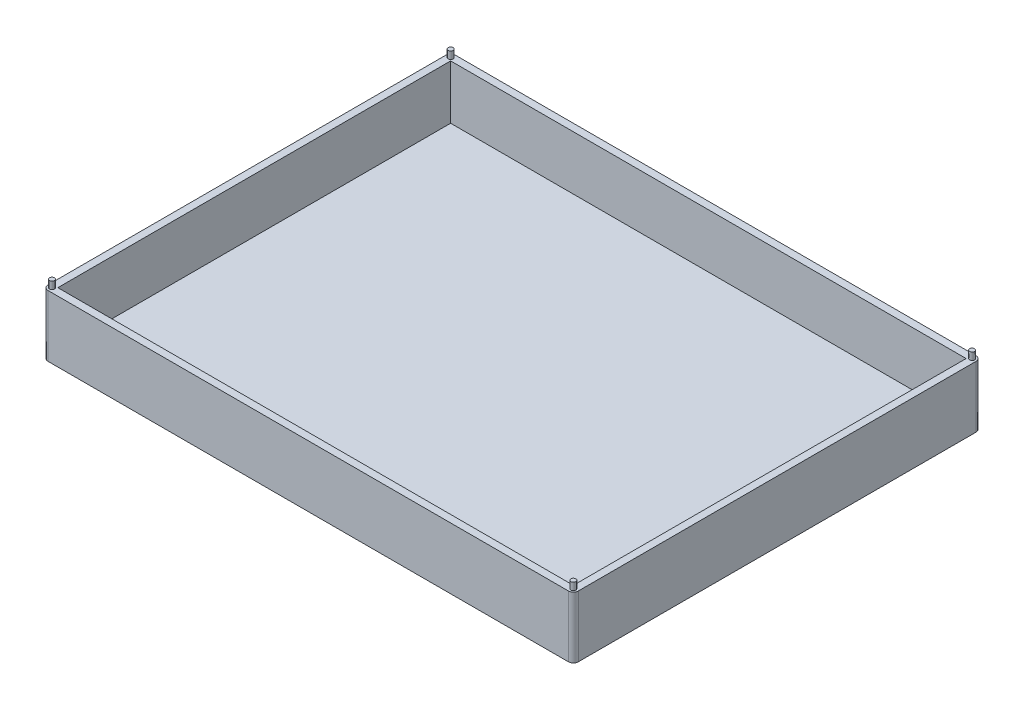
ISO-10303-21;
HEADER;
FILE_DESCRIPTION(('STEP AP214'),'2;1');
FILE_NAME('part.step','',(''),(''),'','','');
FILE_SCHEMA(('AUTOMOTIVE_DESIGN { 1 0 10303 214 1 1 1 1 }'));
ENDSEC;
DATA;
#1=APPLICATION_CONTEXT('core data for automotive mechanical design processes');
#2=APPLICATION_PROTOCOL_DEFINITION('international standard','automotive_design',2000,#1);
#3=PRODUCT_CONTEXT('',#1,'mechanical');
#4=PRODUCT('Part','Part','',(#3));
#5=PRODUCT_RELATED_PRODUCT_CATEGORY('part','',(#4));
#6=PRODUCT_DEFINITION_FORMATION('','',#4);
#7=PRODUCT_DEFINITION_CONTEXT('part definition',#1,'design');
#8=PRODUCT_DEFINITION('design','',#6,#7);
#9=PRODUCT_DEFINITION_SHAPE('','',#8);
#10=(LENGTH_UNIT() NAMED_UNIT(*) SI_UNIT(.MILLI.,.METRE.));
#11=(NAMED_UNIT(*) PLANE_ANGLE_UNIT() SI_UNIT($,.RADIAN.));
#12=(NAMED_UNIT(*) SI_UNIT($,.STERADIAN.) SOLID_ANGLE_UNIT());
#13=UNCERTAINTY_MEASURE_WITH_UNIT(LENGTH_MEASURE(1.E-05),#10,'distance_accuracy_value','');
#14=(GEOMETRIC_REPRESENTATION_CONTEXT(3) GLOBAL_UNCERTAINTY_ASSIGNED_CONTEXT((#13)) GLOBAL_UNIT_ASSIGNED_CONTEXT((#10,
#11,#12)) REPRESENTATION_CONTEXT('',''));
#15=CARTESIAN_POINT('',(0.,0.,0.));
#16=DIRECTION('',(0.,0.,1.));
#17=DIRECTION('',(1.,0.,0.));
#18=AXIS2_PLACEMENT_3D('',#15,#16,#17);
#19=CARTESIAN_POINT('',(0.,25.,0.));
#20=DIRECTION('',(0.,1.,0.));
#21=DIRECTION('',(0.,0.,1.));
#22=AXIS2_PLACEMENT_3D('',#19,#20,#21);
#23=PLANE('',#22);
#24=CARTESIAN_POINT('',(157.231114613234,25.,-60.6881794418821));
#25=DIRECTION('',(0.,1.,0.));
#26=DIRECTION('',(0.,0.,1.));
#27=AXIS2_PLACEMENT_3D('',#24,#25,#26);
#28=CIRCLE('',#27,0.999999999999998);
#29=CARTESIAN_POINT('',(157.231114613234,25.,-59.6881794418821));
#30=VERTEX_POINT('',#29);
#31=EDGE_CURVE('E514',#30,#30,#28,.T.);
#32=ORIENTED_EDGE('',*,*,#31,.F.);
#33=EDGE_LOOP('',(#32));
#34=FACE_BOUND('',#33,.T.);
#35=CARTESIAN_POINT('',(157.231114613234,25.,101.711820558118));
#36=DIRECTION('',(0.,1.,0.));
#37=DIRECTION('',(0.,0.,1.));
#38=AXIS2_PLACEMENT_3D('',#35,#36,#37);
#39=CIRCLE('',#38,0.999999999999998);
#40=CARTESIAN_POINT('',(157.231114613234,25.,102.711820558118));
#41=VERTEX_POINT('',#40);
#42=EDGE_CURVE('E506',#41,#41,#39,.T.);
#43=ORIENTED_EDGE('',*,*,#42,.F.);
#44=EDGE_LOOP('',(#43));
#45=FACE_BOUND('',#44,.T.);
#46=CARTESIAN_POINT('',(-55.168885386766,25.,101.711820558118));
#47=DIRECTION('',(0.,1.,0.));
#48=DIRECTION('',(0.,0.,1.));
#49=AXIS2_PLACEMENT_3D('',#46,#47,#48);
#50=CIRCLE('',#49,0.999999999999998);
#51=CARTESIAN_POINT('',(-55.168885386766,25.,102.711820558118));
#52=VERTEX_POINT('',#51);
#53=EDGE_CURVE('E498',#52,#52,#50,.T.);
#54=ORIENTED_EDGE('',*,*,#53,.F.);
#55=EDGE_LOOP('',(#54));
#56=FACE_BOUND('',#55,.T.);
#57=CARTESIAN_POINT('',(-55.168885386766,25.,-60.6881794418821));
#58=DIRECTION('',(0.,1.,0.));
#59=DIRECTION('',(0.,0.,1.));
#60=AXIS2_PLACEMENT_3D('',#57,#58,#59);
#61=CIRCLE('',#60,0.999999999999998);
#62=CARTESIAN_POINT('',(-55.168885386766,25.,-59.6881794418821));
#63=VERTEX_POINT('',#62);
#64=EDGE_CURVE('E490',#63,#63,#61,.T.);
#65=ORIENTED_EDGE('',*,*,#64,.F.);
#66=EDGE_LOOP('',(#65));
#67=FACE_BOUND('',#66,.T.);
#68=DIRECTION('',(-1.,0.,0.));
#69=VECTOR('',#68,1.);
#70=CARTESIAN_POINT('',(159.031114613234,25.,-62.4881794418821));
#71=LINE('',#70,#69);
#72=CARTESIAN_POINT('',(157.031114613234,25.,-62.4881794418821));
#73=VERTEX_POINT('',#72);
#74=CARTESIAN_POINT('',(-54.968885386766,25.,-62.4881794418821));
#75=VERTEX_POINT('',#74);
#76=EDGE_CURVE('E198',#73,#75,#71,.T.);
#77=ORIENTED_EDGE('',*,*,#76,.T.);
#78=CARTESIAN_POINT('',(-54.968885386766,25.,-60.4881794418821));
#79=DIRECTION('',(0.,1.,0.));
#80=DIRECTION('',(0.,0.,1.));
#81=AXIS2_PLACEMENT_3D('',#78,#79,#80);
#82=CIRCLE('',#81,2.);
#83=CARTESIAN_POINT('',(-56.968885386766,25.,-60.4881794418821));
#84=VERTEX_POINT('',#83);
#85=EDGE_CURVE('E12',#75,#84,#82,.T.);
#86=ORIENTED_EDGE('',*,*,#85,.T.);
#87=DIRECTION('',(0.,0.,1.));
#88=VECTOR('',#87,1.);
#89=CARTESIAN_POINT('',(-56.968885386766,25.,-62.4881794418821));
#90=LINE('',#89,#88);
#91=CARTESIAN_POINT('',(-56.968885386766,25.,101.511820558118));
#92=VERTEX_POINT('',#91);
#93=EDGE_CURVE('E194',#84,#92,#90,.T.);
#94=ORIENTED_EDGE('',*,*,#93,.T.);
#95=CARTESIAN_POINT('',(-54.968885386766,25.,101.511820558118));
#96=DIRECTION('',(0.,1.,0.));
#97=DIRECTION('',(0.,0.,1.));
#98=AXIS2_PLACEMENT_3D('',#95,#96,#97);
#99=CIRCLE('',#98,2.);
#100=CARTESIAN_POINT('',(-54.968885386766,25.,103.511820558118));
#101=VERTEX_POINT('',#100);
#102=EDGE_CURVE('E255',#92,#101,#99,.T.);
#103=ORIENTED_EDGE('',*,*,#102,.T.);
#104=DIRECTION('',(-1.,0.,0.));
#105=VECTOR('',#104,1.);
#106=CARTESIAN_POINT('',(159.031114613234,25.,103.511820558118));
#107=LINE('',#106,#105);
#108=CARTESIAN_POINT('',(157.031114613234,25.,103.511820558118));
#109=VERTEX_POINT('',#108);
#110=EDGE_CURVE('E190',#109,#101,#107,.T.);
#111=ORIENTED_EDGE('',*,*,#110,.F.);
#112=CARTESIAN_POINT('',(157.031114613234,25.,101.511820558118));
#113=DIRECTION('',(0.,1.,0.));
#114=DIRECTION('',(0.,0.,1.));
#115=AXIS2_PLACEMENT_3D('',#112,#113,#114);
#116=CIRCLE('',#115,2.);
#117=CARTESIAN_POINT('',(159.031114613234,25.,101.511820558118));
#118=VERTEX_POINT('',#117);
#119=EDGE_CURVE('E240',#109,#118,#116,.T.);
#120=ORIENTED_EDGE('',*,*,#119,.T.);
#121=DIRECTION('',(0.,0.,1.));
#122=VECTOR('',#121,1.);
#123=CARTESIAN_POINT('',(159.031114613234,25.,-62.4881794418821));
#124=LINE('',#123,#122);
#125=CARTESIAN_POINT('',(159.031114613234,25.,-60.4881794418821));
#126=VERTEX_POINT('',#125);
#127=EDGE_CURVE('E201',#126,#118,#124,.T.);
#128=ORIENTED_EDGE('',*,*,#127,.F.);
#129=CARTESIAN_POINT('',(157.031114613234,25.,-60.4881794418821));
#130=DIRECTION('',(0.,1.,0.));
#131=DIRECTION('',(0.,0.,1.));
#132=AXIS2_PLACEMENT_3D('',#129,#130,#131);
#133=CIRCLE('',#132,2.);
#134=EDGE_CURVE('E227',#126,#73,#133,.T.);
#135=ORIENTED_EDGE('',*,*,#134,.T.);
#136=EDGE_LOOP('',(#77,#86,#94,#103,#111,#120,#128,#135));
#137=FACE_BOUND('',#136,.T.);
#138=DIRECTION('',(1.,0.,0.));
#139=VECTOR('',#138,1.);
#140=CARTESIAN_POINT('',(-53.968885386766,25.,100.511820558118));
#141=LINE('',#140,#139);
#142=CARTESIAN_POINT('',(-53.968885386766,25.,100.511820558118));
#143=VERTEX_POINT('',#142);
#144=CARTESIAN_POINT('',(156.031114613234,25.,100.511820558118));
#145=VERTEX_POINT('',#144);
#146=EDGE_CURVE('E178',#143,#145,#141,.T.);
#147=ORIENTED_EDGE('',*,*,#146,.F.);
#148=DIRECTION('',(0.,0.,1.));
#149=VECTOR('',#148,1.);
#150=CARTESIAN_POINT('',(-53.968885386766,25.,-59.4881794418821));
#151=LINE('',#150,#149);
#152=CARTESIAN_POINT('',(-53.968885386766,25.,-59.4881794418821));
#153=VERTEX_POINT('',#152);
#154=EDGE_CURVE('E471',#153,#143,#151,.T.);
#155=ORIENTED_EDGE('',*,*,#154,.F.);
#156=DIRECTION('',(1.,0.,0.));
#157=VECTOR('',#156,1.);
#158=CARTESIAN_POINT('',(-53.968885386766,25.,-59.4881794418821));
#159=LINE('',#158,#157);
#160=CARTESIAN_POINT('',(156.031114613234,25.,-59.4881794418821));
#161=VERTEX_POINT('',#160);
#162=EDGE_CURVE('E474',#153,#161,#159,.T.);
#163=ORIENTED_EDGE('',*,*,#162,.T.);
#164=DIRECTION('',(0.,0.,1.));
#165=VECTOR('',#164,1.);
#166=CARTESIAN_POINT('',(156.031114613234,25.,-59.4881794418821));
#167=LINE('',#166,#165);
#168=EDGE_CURVE('E478',#161,#145,#167,.T.);
#169=ORIENTED_EDGE('',*,*,#168,.T.);
#170=EDGE_LOOP('',(#147,#155,#163,#169));
#171=FACE_BOUND('',#170,.T.);
#172=ADVANCED_FACE('F63',(#34,#45,#56,#67,#137,#171),#23,.T.);
#173=CARTESIAN_POINT('',(0.,0.,0.));
#174=DIRECTION('',(0.,1.,0.));
#175=DIRECTION('',(0.,0.,1.));
#176=AXIS2_PLACEMENT_3D('',#173,#174,#175);
#177=PLANE('',#176);
#178=DIRECTION('',(0.,0.,1.));
#179=VECTOR('',#178,1.);
#180=CARTESIAN_POINT('',(-56.968885386766,0.,-62.4881794418821));
#181=LINE('',#180,#179);
#182=CARTESIAN_POINT('',(-56.968885386766,0.,-60.4881794418821));
#183=VERTEX_POINT('',#182);
#184=CARTESIAN_POINT('',(-56.968885386766,0.,101.511820558118));
#185=VERTEX_POINT('',#184);
#186=EDGE_CURVE('E209',#183,#185,#181,.T.);
#187=ORIENTED_EDGE('',*,*,#186,.F.);
#188=CARTESIAN_POINT('',(-54.968885386766,0.,-60.4881794418821));
#189=DIRECTION('',(0.,1.,0.));
#190=DIRECTION('',(0.,0.,1.));
#191=AXIS2_PLACEMENT_3D('',#188,#189,#190);
#192=CIRCLE('',#191,2.);
#193=CARTESIAN_POINT('',(-54.968885386766,0.,-62.4881794418821));
#194=VERTEX_POINT('',#193);
#195=EDGE_CURVE('E86',#183,#194,#192,.F.);
#196=ORIENTED_EDGE('',*,*,#195,.T.);
#197=DIRECTION('',(-1.,0.,0.));
#198=VECTOR('',#197,1.);
#199=CARTESIAN_POINT('',(159.031114613234,0.,-62.4881794418821));
#200=LINE('',#199,#198);
#201=CARTESIAN_POINT('',(157.031114613234,0.,-62.4881794418821));
#202=VERTEX_POINT('',#201);
#203=EDGE_CURVE('E212',#202,#194,#200,.T.);
#204=ORIENTED_EDGE('',*,*,#203,.F.);
#205=CARTESIAN_POINT('',(157.031114613234,0.,-60.4881794418821));
#206=DIRECTION('',(0.,1.,0.));
#207=DIRECTION('',(0.,0.,1.));
#208=AXIS2_PLACEMENT_3D('',#205,#206,#207);
#209=CIRCLE('',#208,2.);
#210=CARTESIAN_POINT('',(159.031114613234,0.,-60.4881794418821));
#211=VERTEX_POINT('',#210);
#212=EDGE_CURVE('E221',#202,#211,#209,.F.);
#213=ORIENTED_EDGE('',*,*,#212,.T.);
#214=DIRECTION('',(0.,0.,1.));
#215=VECTOR('',#214,1.);
#216=CARTESIAN_POINT('',(159.031114613234,0.,-62.4881794418821));
#217=LINE('',#216,#215);
#218=CARTESIAN_POINT('',(159.031114613234,0.,101.511820558118));
#219=VERTEX_POINT('',#218);
#220=EDGE_CURVE('E195',#211,#219,#217,.T.);
#221=ORIENTED_EDGE('',*,*,#220,.T.);
#222=CARTESIAN_POINT('',(157.031114613234,0.,101.511820558118));
#223=DIRECTION('',(0.,1.,0.));
#224=DIRECTION('',(0.,0.,1.));
#225=AXIS2_PLACEMENT_3D('',#222,#223,#224);
#226=CIRCLE('',#225,2.);
#227=CARTESIAN_POINT('',(157.031114613234,0.,103.511820558118));
#228=VERTEX_POINT('',#227);
#229=EDGE_CURVE('E234',#219,#228,#226,.F.);
#230=ORIENTED_EDGE('',*,*,#229,.T.);
#231=DIRECTION('',(-1.,0.,0.));
#232=VECTOR('',#231,1.);
#233=CARTESIAN_POINT('',(159.031114613234,0.,103.511820558118));
#234=LINE('',#233,#232);
#235=CARTESIAN_POINT('',(-54.968885386766,0.,103.511820558118));
#236=VERTEX_POINT('',#235);
#237=EDGE_CURVE('E184',#228,#236,#234,.T.);
#238=ORIENTED_EDGE('',*,*,#237,.T.);
#239=CARTESIAN_POINT('',(-54.968885386766,0.,101.511820558118));
#240=DIRECTION('',(0.,1.,0.));
#241=DIRECTION('',(0.,0.,1.));
#242=AXIS2_PLACEMENT_3D('',#239,#240,#241);
#243=CIRCLE('',#242,2.);
#244=EDGE_CURVE('E247',#236,#185,#243,.F.);
#245=ORIENTED_EDGE('',*,*,#244,.T.);
#246=EDGE_LOOP('',(#187,#196,#204,#213,#221,#230,#238,#245));
#247=FACE_BOUND('',#246,.T.);
#248=ADVANCED_FACE('F270',(#247),#177,.F.);
#249=CARTESIAN_POINT('',(159.031114613234,25.,103.511820558118));
#250=DIRECTION('',(0.,0.,1.));
#251=DIRECTION('',(1.,0.,0.));
#252=AXIS2_PLACEMENT_3D('',#249,#250,#251);
#253=PLANE('',#252);
#254=ORIENTED_EDGE('',*,*,#110,.T.);
#255=DIRECTION('',(0.,-1.,0.));
#256=VECTOR('',#255,1.);
#257=CARTESIAN_POINT('',(-54.968885386766,0.,103.511820558118));
#258=LINE('',#257,#256);
#259=EDGE_CURVE('E243',#101,#236,#258,.T.);
#260=ORIENTED_EDGE('',*,*,#259,.T.);
#261=ORIENTED_EDGE('',*,*,#237,.F.);
#262=DIRECTION('',(0.,-1.,0.));
#263=VECTOR('',#262,1.);
#264=CARTESIAN_POINT('',(157.031114613234,25.,103.511820558118));
#265=LINE('',#264,#263);
#266=EDGE_CURVE('E237',#228,#109,#265,.F.);
#267=ORIENTED_EDGE('',*,*,#266,.T.);
#268=EDGE_LOOP('',(#254,#260,#261,#267));
#269=FACE_BOUND('',#268,.T.);
#270=ADVANCED_FACE('F282',(#269),#253,.T.);
#271=CARTESIAN_POINT('',(159.031114613234,25.,-62.4881794418821));
#272=DIRECTION('',(1.,0.,0.));
#273=DIRECTION('',(0.,0.,-1.));
#274=AXIS2_PLACEMENT_3D('',#271,#272,#273);
#275=PLANE('',#274);
#276=ORIENTED_EDGE('',*,*,#127,.T.);
#277=DIRECTION('',(0.,-1.,0.));
#278=VECTOR('',#277,1.);
#279=CARTESIAN_POINT('',(159.031114613234,25.,101.511820558118));
#280=LINE('',#279,#278);
#281=EDGE_CURVE('E230',#118,#219,#280,.T.);
#282=ORIENTED_EDGE('',*,*,#281,.T.);
#283=ORIENTED_EDGE('',*,*,#220,.F.);
#284=DIRECTION('',(0.,-1.,0.));
#285=VECTOR('',#284,1.);
#286=CARTESIAN_POINT('',(159.031114613234,25.,-60.4881794418821));
#287=LINE('',#286,#285);
#288=EDGE_CURVE('E224',#211,#126,#287,.F.);
#289=ORIENTED_EDGE('',*,*,#288,.T.);
#290=EDGE_LOOP('',(#276,#282,#283,#289));
#291=FACE_BOUND('',#290,.T.);
#292=ADVANCED_FACE('F290',(#291),#275,.T.);
#293=CARTESIAN_POINT('',(159.031114613234,25.,-62.4881794418821));
#294=DIRECTION('',(0.,0.,1.));
#295=DIRECTION('',(1.,0.,0.));
#296=AXIS2_PLACEMENT_3D('',#293,#294,#295);
#297=PLANE('',#296);
#298=ORIENTED_EDGE('',*,*,#203,.T.);
#299=DIRECTION('',(0.,-1.,0.));
#300=VECTOR('',#299,1.);
#301=CARTESIAN_POINT('',(-54.968885386766,25.,-62.4881794418821));
#302=LINE('',#301,#300);
#303=EDGE_CURVE('E72',#194,#75,#302,.F.);
#304=ORIENTED_EDGE('',*,*,#303,.T.);
#305=ORIENTED_EDGE('',*,*,#76,.F.);
#306=DIRECTION('',(0.,-1.,0.));
#307=VECTOR('',#306,1.);
#308=CARTESIAN_POINT('',(157.031114613234,0.,-62.4881794418821));
#309=LINE('',#308,#307);
#310=EDGE_CURVE('E205',#73,#202,#309,.T.);
#311=ORIENTED_EDGE('',*,*,#310,.T.);
#312=EDGE_LOOP('',(#298,#304,#305,#311));
#313=FACE_BOUND('',#312,.T.);
#314=ADVANCED_FACE('F296',(#313),#297,.F.);
#315=CARTESIAN_POINT('',(-56.968885386766,25.,-62.4881794418821));
#316=DIRECTION('',(1.,0.,0.));
#317=DIRECTION('',(0.,0.,-1.));
#318=AXIS2_PLACEMENT_3D('',#315,#316,#317);
#319=PLANE('',#318);
#320=ORIENTED_EDGE('',*,*,#93,.F.);
#321=DIRECTION('',(0.,-1.,0.));
#322=VECTOR('',#321,1.);
#323=CARTESIAN_POINT('',(-56.968885386766,25.,-60.4881794418821));
#324=LINE('',#323,#322);
#325=EDGE_CURVE('E258',#84,#183,#324,.T.);
#326=ORIENTED_EDGE('',*,*,#325,.T.);
#327=ORIENTED_EDGE('',*,*,#186,.T.);
#328=DIRECTION('',(0.,-1.,0.));
#329=VECTOR('',#328,1.);
#330=CARTESIAN_POINT('',(-56.968885386766,25.,101.511820558118));
#331=LINE('',#330,#329);
#332=EDGE_CURVE('E251',#185,#92,#331,.F.);
#333=ORIENTED_EDGE('',*,*,#332,.T.);
#334=EDGE_LOOP('',(#320,#326,#327,#333));
#335=FACE_BOUND('',#334,.T.);
#336=ADVANCED_FACE('F267',(#335),#319,.F.);
#337=CARTESIAN_POINT('',(-53.968885386766,25.,-59.4881794418821));
#338=DIRECTION('',(1.,0.,0.));
#339=DIRECTION('',(0.,0.,-1.));
#340=AXIS2_PLACEMENT_3D('',#337,#338,#339);
#341=PLANE('',#340);
#342=DIRECTION('',(0.,0.,-1.));
#343=VECTOR('',#342,1.);
#344=CARTESIAN_POINT('',(-53.968885386766,3.,100.511820558118));
#345=LINE('',#344,#343);
#346=CARTESIAN_POINT('',(-53.968885386766,3.,100.511820558118));
#347=VERTEX_POINT('',#346);
#348=CARTESIAN_POINT('',(-53.968885386766,3.,-59.4881794418821));
#349=VERTEX_POINT('',#348);
#350=EDGE_CURVE('E158',#347,#349,#345,.T.);
#351=ORIENTED_EDGE('',*,*,#350,.T.);
#352=DIRECTION('',(0.,-1.,0.));
#353=VECTOR('',#352,1.);
#354=CARTESIAN_POINT('',(-53.968885386766,25.,-59.4881794418821));
#355=LINE('',#354,#353);
#356=EDGE_CURVE('E186',#153,#349,#355,.T.);
#357=ORIENTED_EDGE('',*,*,#356,.F.);
#358=ORIENTED_EDGE('',*,*,#154,.T.);
#359=DIRECTION('',(0.,-1.,0.));
#360=VECTOR('',#359,1.);
#361=CARTESIAN_POINT('',(-53.968885386766,25.,100.511820558118));
#362=LINE('',#361,#360);
#363=EDGE_CURVE('E180',#143,#347,#362,.T.);
#364=ORIENTED_EDGE('',*,*,#363,.T.);
#365=EDGE_LOOP('',(#351,#357,#358,#364));
#366=FACE_BOUND('',#365,.T.);
#367=ADVANCED_FACE('F316',(#366),#341,.T.);
#368=CARTESIAN_POINT('',(-53.968885386766,25.,100.511820558118));
#369=DIRECTION('',(0.,0.,-1.));
#370=DIRECTION('',(-1.,0.,0.));
#371=AXIS2_PLACEMENT_3D('',#368,#369,#370);
#372=PLANE('',#371);
#373=DIRECTION('',(1.,0.,0.));
#374=VECTOR('',#373,1.);
#375=CARTESIAN_POINT('',(-53.968885386766,3.,100.511820558118));
#376=LINE('',#375,#374);
#377=CARTESIAN_POINT('',(156.031114613234,3.,100.511820558118));
#378=VERTEX_POINT('',#377);
#379=EDGE_CURVE('E152',#347,#378,#376,.T.);
#380=ORIENTED_EDGE('',*,*,#379,.F.);
#381=ORIENTED_EDGE('',*,*,#363,.F.);
#382=ORIENTED_EDGE('',*,*,#146,.T.);
#383=DIRECTION('',(0.,-1.,0.));
#384=VECTOR('',#383,1.);
#385=CARTESIAN_POINT('',(156.031114613234,25.,100.511820558118));
#386=LINE('',#385,#384);
#387=EDGE_CURVE('E169',#145,#378,#386,.T.);
#388=ORIENTED_EDGE('',*,*,#387,.T.);
#389=EDGE_LOOP('',(#380,#381,#382,#388));
#390=FACE_BOUND('',#389,.T.);
#391=ADVANCED_FACE('F176',(#390),#372,.T.);
#392=CARTESIAN_POINT('',(156.031114613234,25.,-59.4881794418821));
#393=DIRECTION('',(1.,0.,0.));
#394=DIRECTION('',(0.,0.,-1.));
#395=AXIS2_PLACEMENT_3D('',#392,#393,#394);
#396=PLANE('',#395);
#397=DIRECTION('',(0.,-1.,0.));
#398=VECTOR('',#397,1.);
#399=CARTESIAN_POINT('',(156.031114613234,25.,-59.4881794418821));
#400=LINE('',#399,#398);
#401=CARTESIAN_POINT('',(156.031114613234,3.,-59.4881794418821));
#402=VERTEX_POINT('',#401);
#403=EDGE_CURVE('E172',#161,#402,#400,.T.);
#404=ORIENTED_EDGE('',*,*,#403,.T.);
#405=DIRECTION('',(0.,0.,-1.));
#406=VECTOR('',#405,1.);
#407=CARTESIAN_POINT('',(156.031114613234,3.,100.511820558118));
#408=LINE('',#407,#406);
#409=EDGE_CURVE('E155',#378,#402,#408,.T.);
#410=ORIENTED_EDGE('',*,*,#409,.F.);
#411=ORIENTED_EDGE('',*,*,#387,.F.);
#412=ORIENTED_EDGE('',*,*,#168,.F.);
#413=EDGE_LOOP('',(#404,#410,#411,#412));
#414=FACE_BOUND('',#413,.T.);
#415=ADVANCED_FACE('F168',(#414),#396,.F.);
#416=CARTESIAN_POINT('',(-53.968885386766,25.,-59.4881794418821));
#417=DIRECTION('',(0.,0.,-1.));
#418=DIRECTION('',(-1.,0.,0.));
#419=AXIS2_PLACEMENT_3D('',#416,#417,#418);
#420=PLANE('',#419);
#421=ORIENTED_EDGE('',*,*,#356,.T.);
#422=DIRECTION('',(1.,0.,0.));
#423=VECTOR('',#422,1.);
#424=CARTESIAN_POINT('',(-53.968885386766,3.,-59.4881794418821));
#425=LINE('',#424,#423);
#426=EDGE_CURVE('E174',#349,#402,#425,.T.);
#427=ORIENTED_EDGE('',*,*,#426,.T.);
#428=ORIENTED_EDGE('',*,*,#403,.F.);
#429=ORIENTED_EDGE('',*,*,#162,.F.);
#430=EDGE_LOOP('',(#421,#427,#428,#429));
#431=FACE_BOUND('',#430,.T.);
#432=ADVANCED_FACE('F457',(#431),#420,.F.);
#433=CARTESIAN_POINT('',(0.,3.,0.));
#434=DIRECTION('',(0.,1.,0.));
#435=DIRECTION('',(0.,0.,1.));
#436=AXIS2_PLACEMENT_3D('',#433,#434,#435);
#437=PLANE('',#436);
#438=ORIENTED_EDGE('',*,*,#426,.F.);
#439=ORIENTED_EDGE('',*,*,#350,.F.);
#440=ORIENTED_EDGE('',*,*,#379,.T.);
#441=ORIENTED_EDGE('',*,*,#409,.T.);
#442=EDGE_LOOP('',(#438,#439,#440,#441));
#443=FACE_BOUND('',#442,.T.);
#444=ADVANCED_FACE('F154',(#443),#437,.T.);
#445=CARTESIAN_POINT('',(157.031114613234,25.,-60.4881794418821));
#446=DIRECTION('',(0.,1.,0.));
#447=DIRECTION('',(0.,0.,1.));
#448=AXIS2_PLACEMENT_3D('',#445,#446,#447);
#449=CYLINDRICAL_SURFACE('',#448,2.);
#450=ORIENTED_EDGE('',*,*,#134,.F.);
#451=ORIENTED_EDGE('',*,*,#288,.F.);
#452=ORIENTED_EDGE('',*,*,#212,.F.);
#453=ORIENTED_EDGE('',*,*,#310,.F.);
#454=EDGE_LOOP('',(#450,#451,#452,#453));
#455=FACE_BOUND('',#454,.T.);
#456=ADVANCED_FACE('F294',(#455),#449,.T.);
#457=CARTESIAN_POINT('',(157.031114613234,25.,101.511820558118));
#458=DIRECTION('',(0.,-1.,0.));
#459=DIRECTION('',(0.,0.,-1.));
#460=AXIS2_PLACEMENT_3D('',#457,#458,#459);
#461=CYLINDRICAL_SURFACE('',#460,2.);
#462=ORIENTED_EDGE('',*,*,#119,.F.);
#463=ORIENTED_EDGE('',*,*,#266,.F.);
#464=ORIENTED_EDGE('',*,*,#229,.F.);
#465=ORIENTED_EDGE('',*,*,#281,.F.);
#466=EDGE_LOOP('',(#462,#463,#464,#465));
#467=FACE_BOUND('',#466,.T.);
#468=ADVANCED_FACE('F285',(#467),#461,.T.);
#469=CARTESIAN_POINT('',(-54.968885386766,25.,101.511820558118));
#470=DIRECTION('',(0.,1.,0.));
#471=DIRECTION('',(0.,0.,1.));
#472=AXIS2_PLACEMENT_3D('',#469,#470,#471);
#473=CYLINDRICAL_SURFACE('',#472,2.);
#474=ORIENTED_EDGE('',*,*,#102,.F.);
#475=ORIENTED_EDGE('',*,*,#332,.F.);
#476=ORIENTED_EDGE('',*,*,#244,.F.);
#477=ORIENTED_EDGE('',*,*,#259,.F.);
#478=EDGE_LOOP('',(#474,#475,#476,#477));
#479=FACE_BOUND('',#478,.T.);
#480=ADVANCED_FACE('F276',(#479),#473,.T.);
#481=CARTESIAN_POINT('',(-54.968885386766,25.,-60.4881794418821));
#482=DIRECTION('',(0.,-1.,0.));
#483=DIRECTION('',(0.,0.,-1.));
#484=AXIS2_PLACEMENT_3D('',#481,#482,#483);
#485=CYLINDRICAL_SURFACE('',#484,2.);
#486=ORIENTED_EDGE('',*,*,#85,.F.);
#487=ORIENTED_EDGE('',*,*,#303,.F.);
#488=ORIENTED_EDGE('',*,*,#195,.F.);
#489=ORIENTED_EDGE('',*,*,#325,.F.);
#490=EDGE_LOOP('',(#486,#487,#488,#489));
#491=FACE_BOUND('',#490,.T.);
#492=ADVANCED_FACE('F65',(#491),#485,.T.);
#493=CARTESIAN_POINT('',(-55.168885386766,28.,-60.6881794418821));
#494=DIRECTION('',(0.,-1.,0.));
#495=DIRECTION('',(0.,0.,-1.));
#496=AXIS2_PLACEMENT_3D('',#493,#494,#495);
#497=CYLINDRICAL_SURFACE('',#496,0.999999999999998);
#498=CARTESIAN_POINT('',(-55.168885386766,28.,-60.6881794418821));
#499=DIRECTION('',(0.,1.,0.));
#500=DIRECTION('',(0.,0.,1.));
#501=AXIS2_PLACEMENT_3D('',#498,#499,#500);
#502=CIRCLE('',#501,0.999999999999998);
#503=CARTESIAN_POINT('',(-55.168885386766,28.,-59.6881794418821));
#504=VERTEX_POINT('',#503);
#505=EDGE_CURVE('E489',#504,#504,#502,.T.);
#506=ORIENTED_EDGE('',*,*,#505,.F.);
#507=EDGE_LOOP('',(#506));
#508=FACE_BOUND('',#507,.T.);
#509=ORIENTED_EDGE('',*,*,#64,.T.);
#510=EDGE_LOOP('',(#509));
#511=FACE_BOUND('',#510,.T.);
#512=ADVANCED_FACE('F298',(#508,#511),#497,.T.);
#513=CARTESIAN_POINT('',(-55.168885386766,28.,-60.6881794418821));
#514=DIRECTION('',(0.,1.,0.));
#515=DIRECTION('',(0.,0.,1.));
#516=AXIS2_PLACEMENT_3D('',#513,#514,#515);
#517=PLANE('',#516);
#518=ORIENTED_EDGE('',*,*,#505,.T.);
#519=EDGE_LOOP('',(#518));
#520=FACE_BOUND('',#519,.T.);
#521=ADVANCED_FACE('F303',(#520),#517,.T.);
#522=CARTESIAN_POINT('',(-55.168885386766,28.,101.711820558118));
#523=DIRECTION('',(0.,-1.,0.));
#524=DIRECTION('',(0.,0.,-1.));
#525=AXIS2_PLACEMENT_3D('',#522,#523,#524);
#526=CYLINDRICAL_SURFACE('',#525,0.999999999999998);
#527=CARTESIAN_POINT('',(-55.168885386766,28.,101.711820558118));
#528=DIRECTION('',(0.,1.,0.));
#529=DIRECTION('',(0.,0.,1.));
#530=AXIS2_PLACEMENT_3D('',#527,#528,#529);
#531=CIRCLE('',#530,0.999999999999998);
#532=CARTESIAN_POINT('',(-55.168885386766,28.,102.711820558118));
#533=VERTEX_POINT('',#532);
#534=EDGE_CURVE('E494',#533,#533,#531,.T.);
#535=ORIENTED_EDGE('',*,*,#534,.F.);
#536=EDGE_LOOP('',(#535));
#537=FACE_BOUND('',#536,.T.);
#538=ORIENTED_EDGE('',*,*,#53,.T.);
#539=EDGE_LOOP('',(#538));
#540=FACE_BOUND('',#539,.T.);
#541=ADVANCED_FACE('F386',(#537,#540),#526,.T.);
#542=CARTESIAN_POINT('',(-55.168885386766,28.,101.711820558118));
#543=DIRECTION('',(0.,1.,0.));
#544=DIRECTION('',(0.,0.,1.));
#545=AXIS2_PLACEMENT_3D('',#542,#543,#544);
#546=PLANE('',#545);
#547=ORIENTED_EDGE('',*,*,#534,.T.);
#548=EDGE_LOOP('',(#547));
#549=FACE_BOUND('',#548,.T.);
#550=ADVANCED_FACE('F396',(#549),#546,.T.);
#551=CARTESIAN_POINT('',(157.231114613234,28.,101.711820558118));
#552=DIRECTION('',(0.,-1.,0.));
#553=DIRECTION('',(0.,0.,-1.));
#554=AXIS2_PLACEMENT_3D('',#551,#552,#553);
#555=CYLINDRICAL_SURFACE('',#554,0.999999999999998);
#556=CARTESIAN_POINT('',(157.231114613234,28.,101.711820558118));
#557=DIRECTION('',(0.,1.,0.));
#558=DIRECTION('',(0.,0.,1.));
#559=AXIS2_PLACEMENT_3D('',#556,#557,#558);
#560=CIRCLE('',#559,0.999999999999998);
#561=CARTESIAN_POINT('',(157.231114613234,28.,102.711820558118));
#562=VERTEX_POINT('',#561);
#563=EDGE_CURVE('E502',#562,#562,#560,.T.);
#564=ORIENTED_EDGE('',*,*,#563,.F.);
#565=EDGE_LOOP('',(#564));
#566=FACE_BOUND('',#565,.T.);
#567=ORIENTED_EDGE('',*,*,#42,.T.);
#568=EDGE_LOOP('',(#567));
#569=FACE_BOUND('',#568,.T.);
#570=ADVANCED_FACE('F406',(#566,#569),#555,.T.);
#571=CARTESIAN_POINT('',(157.231114613234,28.,101.711820558118));
#572=DIRECTION('',(0.,1.,0.));
#573=DIRECTION('',(0.,0.,1.));
#574=AXIS2_PLACEMENT_3D('',#571,#572,#573);
#575=PLANE('',#574);
#576=ORIENTED_EDGE('',*,*,#563,.T.);
#577=EDGE_LOOP('',(#576));
#578=FACE_BOUND('',#577,.T.);
#579=ADVANCED_FACE('F416',(#578),#575,.T.);
#580=CARTESIAN_POINT('',(157.231114613234,28.,-60.6881794418821));
#581=DIRECTION('',(0.,-1.,0.));
#582=DIRECTION('',(0.,0.,-1.));
#583=AXIS2_PLACEMENT_3D('',#580,#581,#582);
#584=CYLINDRICAL_SURFACE('',#583,0.999999999999998);
#585=CARTESIAN_POINT('',(157.231114613234,28.,-60.6881794418821));
#586=DIRECTION('',(0.,1.,0.));
#587=DIRECTION('',(0.,0.,1.));
#588=AXIS2_PLACEMENT_3D('',#585,#586,#587);
#589=CIRCLE('',#588,0.999999999999998);
#590=CARTESIAN_POINT('',(157.231114613234,28.,-59.6881794418821));
#591=VERTEX_POINT('',#590);
#592=EDGE_CURVE('E510',#591,#591,#589,.T.);
#593=ORIENTED_EDGE('',*,*,#592,.F.);
#594=EDGE_LOOP('',(#593));
#595=FACE_BOUND('',#594,.T.);
#596=ORIENTED_EDGE('',*,*,#31,.T.);
#597=EDGE_LOOP('',(#596));
#598=FACE_BOUND('',#597,.T.);
#599=ADVANCED_FACE('F425',(#595,#598),#584,.T.);
#600=CARTESIAN_POINT('',(157.231114613234,28.,-60.6881794418821));
#601=DIRECTION('',(0.,1.,0.));
#602=DIRECTION('',(0.,0.,1.));
#603=AXIS2_PLACEMENT_3D('',#600,#601,#602);
#604=PLANE('',#603);
#605=ORIENTED_EDGE('',*,*,#592,.T.);
#606=EDGE_LOOP('',(#605));
#607=FACE_BOUND('',#606,.T.);
#608=ADVANCED_FACE('F440',(#607),#604,.T.);
#609=CLOSED_SHELL('',(#172,#248,#270,#292,#314,#336,#367,#391,#415,#432,#444,#456,#468,#480,
#492,#512,#521,#541,#550,#570,#579,#599,#608));
#610=MANIFOLD_SOLID_BREP('B2',#609);
#611=ADVANCED_BREP_SHAPE_REPRESENTATION('',(#18,#610),#14);
#612=SHAPE_DEFINITION_REPRESENTATION(#9,#611);
ENDSEC;
END-ISO-10303-21;
